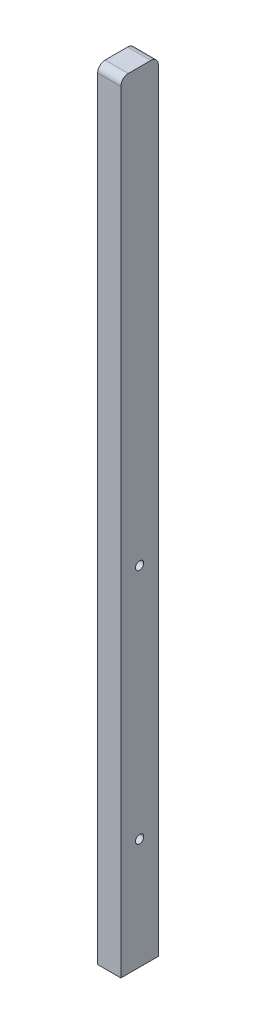
ISO-10303-21;
HEADER;
FILE_DESCRIPTION(('STEP AP214'),'2;1');
FILE_NAME('part.step','',(''),(''),'','','');
FILE_SCHEMA(('AUTOMOTIVE_DESIGN { 1 0 10303 214 1 1 1 1 }'));
ENDSEC;
DATA;
#1=APPLICATION_CONTEXT('core data for automotive mechanical design processes');
#2=APPLICATION_PROTOCOL_DEFINITION('international standard','automotive_design',2000,#1);
#3=PRODUCT_CONTEXT('',#1,'mechanical');
#4=PRODUCT('Part','Part','',(#3));
#5=PRODUCT_RELATED_PRODUCT_CATEGORY('part','',(#4));
#6=PRODUCT_DEFINITION_FORMATION('','',#4);
#7=PRODUCT_DEFINITION_CONTEXT('part definition',#1,'design');
#8=PRODUCT_DEFINITION('design','',#6,#7);
#9=PRODUCT_DEFINITION_SHAPE('','',#8);
#10=(LENGTH_UNIT() NAMED_UNIT(*) SI_UNIT(.MILLI.,.METRE.));
#11=(NAMED_UNIT(*) PLANE_ANGLE_UNIT() SI_UNIT($,.RADIAN.));
#12=(NAMED_UNIT(*) SI_UNIT($,.STERADIAN.) SOLID_ANGLE_UNIT());
#13=UNCERTAINTY_MEASURE_WITH_UNIT(LENGTH_MEASURE(1.E-05),#10,'distance_accuracy_value','');
#14=(GEOMETRIC_REPRESENTATION_CONTEXT(3) GLOBAL_UNCERTAINTY_ASSIGNED_CONTEXT((#13)) GLOBAL_UNIT_ASSIGNED_CONTEXT((#10,
#11,#12)) REPRESENTATION_CONTEXT('',''));
#15=CARTESIAN_POINT('',(0.,0.,0.));
#16=DIRECTION('',(0.,0.,1.));
#17=DIRECTION('',(1.,0.,0.));
#18=AXIS2_PLACEMENT_3D('',#15,#16,#17);
#19=CARTESIAN_POINT('',(-7.75,520.,12.5));
#20=DIRECTION('',(1.,0.,0.));
#21=DIRECTION('',(0.,0.,-1.));
#22=AXIS2_PLACEMENT_3D('',#19,#20,#21);
#23=PLANE('',#22);
#24=CARTESIAN_POINT('',(-7.75,74.,0.));
#25=DIRECTION('',(-1.,0.,0.));
#26=DIRECTION('',(0.,0.,1.));
#27=AXIS2_PLACEMENT_3D('',#24,#25,#26);
#28=CIRCLE('',#27,4.99999999999999);
#29=CARTESIAN_POINT('',(-7.75,74.,4.99999999999999));
#30=VERTEX_POINT('',#29);
#31=EDGE_CURVE('E255',#30,#30,#28,.T.);
#32=ORIENTED_EDGE('',*,*,#31,.F.);
#33=EDGE_LOOP('',(#32));
#34=FACE_BOUND('',#33,.T.);
#35=CARTESIAN_POINT('',(-7.75,232.,0.));
#36=DIRECTION('',(-1.,0.,0.));
#37=DIRECTION('',(0.,0.,1.));
#38=AXIS2_PLACEMENT_3D('',#35,#36,#37);
#39=CIRCLE('',#38,5.);
#40=CARTESIAN_POINT('',(-7.75,232.,5.));
#41=VERTEX_POINT('',#40);
#42=EDGE_CURVE('E269',#41,#41,#39,.T.);
#43=ORIENTED_EDGE('',*,*,#42,.F.);
#44=EDGE_LOOP('',(#43));
#45=FACE_BOUND('',#44,.T.);
#46=DIRECTION('',(0.,-1.,0.));
#47=VECTOR('',#46,1.);
#48=CARTESIAN_POINT('',(-7.75,520.,12.5));
#49=LINE('',#48,#47);
#50=CARTESIAN_POINT('',(-7.75,515.,12.5));
#51=VERTEX_POINT('',#50);
#52=CARTESIAN_POINT('',(-7.75,0.,12.5));
#53=VERTEX_POINT('',#52);
#54=EDGE_CURVE('E150',#51,#53,#49,.T.);
#55=ORIENTED_EDGE('',*,*,#54,.F.);
#56=CARTESIAN_POINT('',(-7.75,515.,7.5));
#57=DIRECTION('',(1.,0.,0.));
#58=DIRECTION('',(0.,0.,-1.));
#59=AXIS2_PLACEMENT_3D('',#56,#57,#58);
#60=CIRCLE('',#59,5.);
#61=CARTESIAN_POINT('',(-7.75,520.,7.5));
#62=VERTEX_POINT('',#61);
#63=EDGE_CURVE('E53',#51,#62,#60,.F.);
#64=ORIENTED_EDGE('',*,*,#63,.T.);
#65=DIRECTION('',(0.,0.,1.));
#66=VECTOR('',#65,1.);
#67=CARTESIAN_POINT('',(-7.75,520.,12.5));
#68=LINE('',#67,#66);
#69=CARTESIAN_POINT('',(-7.75,520.,-7.49999999999999));
#70=VERTEX_POINT('',#69);
#71=EDGE_CURVE('E122',#70,#62,#68,.T.);
#72=ORIENTED_EDGE('',*,*,#71,.F.);
#73=CARTESIAN_POINT('',(-7.75,515.,-7.5));
#74=DIRECTION('',(1.,0.,0.));
#75=DIRECTION('',(0.,0.,-1.));
#76=AXIS2_PLACEMENT_3D('',#73,#74,#75);
#77=CIRCLE('',#76,5.);
#78=CARTESIAN_POINT('',(-7.75,515.,-12.5));
#79=VERTEX_POINT('',#78);
#80=EDGE_CURVE('E60',#70,#79,#77,.F.);
#81=ORIENTED_EDGE('',*,*,#80,.T.);
#82=DIRECTION('',(0.,-1.,0.));
#83=VECTOR('',#82,1.);
#84=CARTESIAN_POINT('',(-7.75,520.,-12.5));
#85=LINE('',#84,#83);
#86=CARTESIAN_POINT('',(-7.75,0.,-12.5));
#87=VERTEX_POINT('',#86);
#88=EDGE_CURVE('E130',#79,#87,#85,.T.);
#89=ORIENTED_EDGE('',*,*,#88,.T.);
#90=DIRECTION('',(0.,0.,1.));
#91=VECTOR('',#90,1.);
#92=CARTESIAN_POINT('',(-7.75,0.,12.5));
#93=LINE('',#92,#91);
#94=EDGE_CURVE('E109',#87,#53,#93,.T.);
#95=ORIENTED_EDGE('',*,*,#94,.T.);
#96=EDGE_LOOP('',(#55,#64,#72,#81,#89,#95));
#97=FACE_BOUND('',#96,.T.);
#98=ADVANCED_FACE('F44',(#34,#45,#97),#23,.F.);
#99=CARTESIAN_POINT('',(7.75,520.,12.5));
#100=DIRECTION('',(0.,0.,-1.));
#101=DIRECTION('',(-1.,0.,0.));
#102=AXIS2_PLACEMENT_3D('',#99,#100,#101);
#103=PLANE('',#102);
#104=DIRECTION('',(0.,-1.,0.));
#105=VECTOR('',#104,1.);
#106=CARTESIAN_POINT('',(7.75,520.,12.5));
#107=LINE('',#106,#105);
#108=CARTESIAN_POINT('',(7.75,515.,12.5));
#109=VERTEX_POINT('',#108);
#110=CARTESIAN_POINT('',(7.75,0.,12.5));
#111=VERTEX_POINT('',#110);
#112=EDGE_CURVE('E147',#109,#111,#107,.T.);
#113=ORIENTED_EDGE('',*,*,#112,.F.);
#114=DIRECTION('',(1.,0.,0.));
#115=VECTOR('',#114,1.);
#116=CARTESIAN_POINT('',(-7.75,515.,12.5));
#117=LINE('',#116,#115);
#118=EDGE_CURVE('E68',#109,#51,#117,.F.);
#119=ORIENTED_EDGE('',*,*,#118,.T.);
#120=ORIENTED_EDGE('',*,*,#54,.T.);
#121=DIRECTION('',(1.,0.,0.));
#122=VECTOR('',#121,1.);
#123=CARTESIAN_POINT('',(7.75,0.,12.5));
#124=LINE('',#123,#122);
#125=EDGE_CURVE('E115',#53,#111,#124,.T.);
#126=ORIENTED_EDGE('',*,*,#125,.T.);
#127=EDGE_LOOP('',(#113,#119,#120,#126));
#128=FACE_BOUND('',#127,.T.);
#129=ADVANCED_FACE('F181',(#128),#103,.F.);
#130=CARTESIAN_POINT('',(7.75,520.,12.5));
#131=DIRECTION('',(-1.,0.,0.));
#132=DIRECTION('',(0.,0.,1.));
#133=AXIS2_PLACEMENT_3D('',#130,#131,#132);
#134=PLANE('',#133);
#135=CARTESIAN_POINT('',(7.75,74.,0.));
#136=DIRECTION('',(-1.,0.,0.));
#137=DIRECTION('',(0.,0.,1.));
#138=AXIS2_PLACEMENT_3D('',#135,#136,#137);
#139=CIRCLE('',#138,2.74999999999999);
#140=CARTESIAN_POINT('',(7.75,74.,2.74999999999999));
#141=VERTEX_POINT('',#140);
#142=EDGE_CURVE('E265',#141,#141,#139,.T.);
#143=ORIENTED_EDGE('',*,*,#142,.T.);
#144=EDGE_LOOP('',(#143));
#145=FACE_BOUND('',#144,.T.);
#146=CARTESIAN_POINT('',(7.75,232.,0.));
#147=DIRECTION('',(-1.,0.,0.));
#148=DIRECTION('',(0.,0.,1.));
#149=AXIS2_PLACEMENT_3D('',#146,#147,#148);
#150=CIRCLE('',#149,2.75);
#151=CARTESIAN_POINT('',(7.75,232.,2.75));
#152=VERTEX_POINT('',#151);
#153=EDGE_CURVE('E118',#152,#152,#150,.T.);
#154=ORIENTED_EDGE('',*,*,#153,.T.);
#155=EDGE_LOOP('',(#154));
#156=FACE_BOUND('',#155,.T.);
#157=DIRECTION('',(0.,0.,-1.));
#158=VECTOR('',#157,1.);
#159=CARTESIAN_POINT('',(7.75,520.,12.5));
#160=LINE('',#159,#158);
#161=CARTESIAN_POINT('',(7.75,520.,7.5));
#162=VERTEX_POINT('',#161);
#163=CARTESIAN_POINT('',(7.75,520.,-7.5));
#164=VERTEX_POINT('',#163);
#165=EDGE_CURVE('E126',#162,#164,#160,.T.);
#166=ORIENTED_EDGE('',*,*,#165,.F.);
#167=CARTESIAN_POINT('',(7.75,515.,7.5));
#168=DIRECTION('',(-1.,0.,0.));
#169=DIRECTION('',(0.,0.,1.));
#170=AXIS2_PLACEMENT_3D('',#167,#168,#169);
#171=CIRCLE('',#170,5.);
#172=EDGE_CURVE('E164',#162,#109,#171,.F.);
#173=ORIENTED_EDGE('',*,*,#172,.T.);
#174=ORIENTED_EDGE('',*,*,#112,.T.);
#175=DIRECTION('',(0.,0.,-1.));
#176=VECTOR('',#175,1.);
#177=CARTESIAN_POINT('',(7.75,0.,12.5));
#178=LINE('',#177,#176);
#179=CARTESIAN_POINT('',(7.75,0.,-12.5));
#180=VERTEX_POINT('',#179);
#181=EDGE_CURVE('E135',#111,#180,#178,.T.);
#182=ORIENTED_EDGE('',*,*,#181,.T.);
#183=DIRECTION('',(0.,-1.,0.));
#184=VECTOR('',#183,1.);
#185=CARTESIAN_POINT('',(7.75,520.,-12.5));
#186=LINE('',#185,#184);
#187=CARTESIAN_POINT('',(7.75,515.,-12.5));
#188=VERTEX_POINT('',#187);
#189=EDGE_CURVE('E144',#188,#180,#186,.T.);
#190=ORIENTED_EDGE('',*,*,#189,.F.);
#191=CARTESIAN_POINT('',(7.75,515.,-7.5));
#192=DIRECTION('',(-1.,0.,0.));
#193=DIRECTION('',(0.,0.,1.));
#194=AXIS2_PLACEMENT_3D('',#191,#192,#193);
#195=CIRCLE('',#194,5.);
#196=EDGE_CURVE('E161',#188,#164,#195,.F.);
#197=ORIENTED_EDGE('',*,*,#196,.T.);
#198=EDGE_LOOP('',(#166,#173,#174,#182,#190,#197));
#199=FACE_BOUND('',#198,.T.);
#200=ADVANCED_FACE('F180',(#145,#156,#199),#134,.F.);
#201=CARTESIAN_POINT('',(7.75,520.,-12.5));
#202=DIRECTION('',(0.,0.,1.));
#203=DIRECTION('',(1.,0.,0.));
#204=AXIS2_PLACEMENT_3D('',#201,#202,#203);
#205=PLANE('',#204);
#206=ORIENTED_EDGE('',*,*,#88,.F.);
#207=DIRECTION('',(-1.,0.,0.));
#208=VECTOR('',#207,1.);
#209=CARTESIAN_POINT('',(7.75,515.,-12.5));
#210=LINE('',#209,#208);
#211=EDGE_CURVE('E11',#79,#188,#210,.F.);
#212=ORIENTED_EDGE('',*,*,#211,.T.);
#213=ORIENTED_EDGE('',*,*,#189,.T.);
#214=DIRECTION('',(-1.,0.,0.));
#215=VECTOR('',#214,1.);
#216=CARTESIAN_POINT('',(7.75,0.,-12.5));
#217=LINE('',#216,#215);
#218=EDGE_CURVE('E127',#180,#87,#217,.T.);
#219=ORIENTED_EDGE('',*,*,#218,.T.);
#220=EDGE_LOOP('',(#206,#212,#213,#219));
#221=FACE_BOUND('',#220,.T.);
#222=ADVANCED_FACE('F193',(#221),#205,.F.);
#223=CARTESIAN_POINT('',(0.,520.,0.));
#224=DIRECTION('',(0.,1.,0.));
#225=DIRECTION('',(0.,0.,1.));
#226=AXIS2_PLACEMENT_3D('',#223,#224,#225);
#227=PLANE('',#226);
#228=ORIENTED_EDGE('',*,*,#71,.T.);
#229=DIRECTION('',(1.,0.,0.));
#230=VECTOR('',#229,1.);
#231=CARTESIAN_POINT('',(7.75,520.,7.5));
#232=LINE('',#231,#230);
#233=EDGE_CURVE('E157',#62,#162,#232,.T.);
#234=ORIENTED_EDGE('',*,*,#233,.T.);
#235=ORIENTED_EDGE('',*,*,#165,.T.);
#236=DIRECTION('',(-1.,0.,0.));
#237=VECTOR('',#236,1.);
#238=CARTESIAN_POINT('',(-7.75,520.,-7.5));
#239=LINE('',#238,#237);
#240=EDGE_CURVE('E153',#164,#70,#239,.T.);
#241=ORIENTED_EDGE('',*,*,#240,.T.);
#242=EDGE_LOOP('',(#228,#234,#235,#241));
#243=FACE_BOUND('',#242,.T.);
#244=ADVANCED_FACE('F175',(#243),#227,.T.);
#245=CARTESIAN_POINT('',(0.,0.,0.));
#246=DIRECTION('',(0.,1.,0.));
#247=DIRECTION('',(0.,0.,1.));
#248=AXIS2_PLACEMENT_3D('',#245,#246,#247);
#249=PLANE('',#248);
#250=CARTESIAN_POINT('',(0.,0.,0.));
#251=DIRECTION('',(0.,-1.,0.));
#252=DIRECTION('',(0.,0.,-1.));
#253=AXIS2_PLACEMENT_3D('',#250,#251,#252);
#254=CIRCLE('',#253,3.3);
#255=CARTESIAN_POINT('',(0.,0.,-3.3));
#256=VERTEX_POINT('',#255);
#257=EDGE_CURVE('E110',#256,#256,#254,.T.);
#258=ORIENTED_EDGE('',*,*,#257,.F.);
#259=EDGE_LOOP('',(#258));
#260=FACE_BOUND('',#259,.T.);
#261=ORIENTED_EDGE('',*,*,#94,.F.);
#262=ORIENTED_EDGE('',*,*,#218,.F.);
#263=ORIENTED_EDGE('',*,*,#181,.F.);
#264=ORIENTED_EDGE('',*,*,#125,.F.);
#265=EDGE_LOOP('',(#261,#262,#263,#264));
#266=FACE_BOUND('',#265,.T.);
#267=ADVANCED_FACE('F187',(#260,#266),#249,.F.);
#268=CARTESIAN_POINT('',(0.,515.,7.5));
#269=DIRECTION('',(-1.,0.,0.));
#270=DIRECTION('',(0.,0.,1.));
#271=AXIS2_PLACEMENT_3D('',#268,#269,#270);
#272=CYLINDRICAL_SURFACE('',#271,5.);
#273=ORIENTED_EDGE('',*,*,#63,.F.);
#274=ORIENTED_EDGE('',*,*,#118,.F.);
#275=ORIENTED_EDGE('',*,*,#172,.F.);
#276=ORIENTED_EDGE('',*,*,#233,.F.);
#277=EDGE_LOOP('',(#273,#274,#275,#276));
#278=FACE_BOUND('',#277,.T.);
#279=ADVANCED_FACE('F178',(#278),#272,.T.);
#280=CARTESIAN_POINT('',(0.,515.,-7.5));
#281=DIRECTION('',(1.,0.,0.));
#282=DIRECTION('',(0.,0.,-1.));
#283=AXIS2_PLACEMENT_3D('',#280,#281,#282);
#284=CYLINDRICAL_SURFACE('',#283,5.);
#285=ORIENTED_EDGE('',*,*,#196,.F.);
#286=ORIENTED_EDGE('',*,*,#211,.F.);
#287=ORIENTED_EDGE('',*,*,#80,.F.);
#288=ORIENTED_EDGE('',*,*,#240,.F.);
#289=EDGE_LOOP('',(#285,#286,#287,#288));
#290=FACE_BOUND('',#289,.T.);
#291=ADVANCED_FACE('F46',(#290),#284,.T.);
#292=CARTESIAN_POINT('',(0.,12.,0.));
#293=DIRECTION('',(0.,-1.,0.));
#294=DIRECTION('',(0.,0.,-1.));
#295=AXIS2_PLACEMENT_3D('',#292,#293,#294);
#296=CONICAL_SURFACE('',#295,3.3,1.02974425867665);
#297=CARTESIAN_POINT('',(0.,13.9828400427909,0.));
#298=VERTEX_POINT('',#297);
#299=VERTEX_LOOP('',#298);
#300=FACE_BOUND('',#299,.T.);
#301=CARTESIAN_POINT('',(0.,12.,0.));
#302=DIRECTION('',(0.,-1.,0.));
#303=DIRECTION('',(0.,0.,-1.));
#304=AXIS2_PLACEMENT_3D('',#301,#302,#303);
#305=CIRCLE('',#304,3.3);
#306=CARTESIAN_POINT('',(0.,12.,-3.3));
#307=VERTEX_POINT('',#306);
#308=EDGE_CURVE('E106',#307,#307,#305,.T.);
#309=ORIENTED_EDGE('',*,*,#308,.T.);
#310=EDGE_LOOP('',(#309));
#311=FACE_BOUND('',#310,.T.);
#312=ADVANCED_FACE('F99',(#300,#311),#296,.F.);
#313=CARTESIAN_POINT('',(0.,0.,0.));
#314=DIRECTION('',(0.,-1.,0.));
#315=DIRECTION('',(0.,0.,-1.));
#316=AXIS2_PLACEMENT_3D('',#313,#314,#315);
#317=CYLINDRICAL_SURFACE('',#316,3.3);
#318=ORIENTED_EDGE('',*,*,#308,.F.);
#319=EDGE_LOOP('',(#318));
#320=FACE_BOUND('',#319,.T.);
#321=ORIENTED_EDGE('',*,*,#257,.T.);
#322=EDGE_LOOP('',(#321));
#323=FACE_BOUND('',#322,.T.);
#324=ADVANCED_FACE('F102',(#320,#323),#317,.F.);
#325=CARTESIAN_POINT('',(-7.75,232.,0.));
#326=DIRECTION('',(-1.,0.,0.));
#327=DIRECTION('',(0.,0.,1.));
#328=AXIS2_PLACEMENT_3D('',#325,#326,#327);
#329=CYLINDRICAL_SURFACE('',#328,2.75);
#330=ORIENTED_EDGE('',*,*,#153,.F.);
#331=EDGE_LOOP('',(#330));
#332=FACE_BOUND('',#331,.T.);
#333=CARTESIAN_POINT('',(-2.35,232.,0.));
#334=DIRECTION('',(-1.,0.,0.));
#335=DIRECTION('',(0.,0.,1.));
#336=AXIS2_PLACEMENT_3D('',#333,#334,#335);
#337=CIRCLE('',#336,2.75);
#338=CARTESIAN_POINT('',(-2.35,232.,2.75));
#339=VERTEX_POINT('',#338);
#340=EDGE_CURVE('E277',#339,#339,#337,.T.);
#341=ORIENTED_EDGE('',*,*,#340,.T.);
#342=EDGE_LOOP('',(#341));
#343=FACE_BOUND('',#342,.T.);
#344=ADVANCED_FACE('F225',(#332,#343),#329,.F.);
#345=CARTESIAN_POINT('',(-2.35,234.75,0.));
#346=DIRECTION('',(1.,0.,0.));
#347=DIRECTION('',(0.,0.,-1.));
#348=AXIS2_PLACEMENT_3D('',#345,#346,#347);
#349=PLANE('',#348);
#350=ORIENTED_EDGE('',*,*,#340,.F.);
#351=EDGE_LOOP('',(#350));
#352=FACE_BOUND('',#351,.T.);
#353=CARTESIAN_POINT('',(-2.35,232.,0.));
#354=DIRECTION('',(-1.,0.,0.));
#355=DIRECTION('',(0.,0.,1.));
#356=AXIS2_PLACEMENT_3D('',#353,#354,#355);
#357=CIRCLE('',#356,5.);
#358=CARTESIAN_POINT('',(-2.35,232.,5.));
#359=VERTEX_POINT('',#358);
#360=EDGE_CURVE('E273',#359,#359,#357,.T.);
#361=ORIENTED_EDGE('',*,*,#360,.T.);
#362=EDGE_LOOP('',(#361));
#363=FACE_BOUND('',#362,.T.);
#364=ADVANCED_FACE('F228',(#352,#363),#349,.F.);
#365=CARTESIAN_POINT('',(-7.75,232.,0.));
#366=DIRECTION('',(-1.,0.,0.));
#367=DIRECTION('',(0.,0.,1.));
#368=AXIS2_PLACEMENT_3D('',#365,#366,#367);
#369=CYLINDRICAL_SURFACE('',#368,5.);
#370=ORIENTED_EDGE('',*,*,#360,.F.);
#371=EDGE_LOOP('',(#370));
#372=FACE_BOUND('',#371,.T.);
#373=ORIENTED_EDGE('',*,*,#42,.T.);
#374=EDGE_LOOP('',(#373));
#375=FACE_BOUND('',#374,.T.);
#376=ADVANCED_FACE('F232',(#372,#375),#369,.F.);
#377=CARTESIAN_POINT('',(-7.75,74.,0.));
#378=DIRECTION('',(-1.,0.,0.));
#379=DIRECTION('',(0.,0.,1.));
#380=AXIS2_PLACEMENT_3D('',#377,#378,#379);
#381=CYLINDRICAL_SURFACE('',#380,2.75);
#382=ORIENTED_EDGE('',*,*,#142,.F.);
#383=EDGE_LOOP('',(#382));
#384=FACE_BOUND('',#383,.T.);
#385=CARTESIAN_POINT('',(-2.35,74.,0.));
#386=DIRECTION('',(-1.,0.,0.));
#387=DIRECTION('',(0.,0.,1.));
#388=AXIS2_PLACEMENT_3D('',#385,#386,#387);
#389=CIRCLE('',#388,2.75000000000002);
#390=CARTESIAN_POINT('',(-2.35,74.,2.75000000000002));
#391=VERTEX_POINT('',#390);
#392=EDGE_CURVE('E259',#391,#391,#389,.T.);
#393=ORIENTED_EDGE('',*,*,#392,.T.);
#394=EDGE_LOOP('',(#393));
#395=FACE_BOUND('',#394,.T.);
#396=ADVANCED_FACE('F236',(#384,#395),#381,.F.);
#397=CARTESIAN_POINT('',(-2.35,76.75,0.));
#398=DIRECTION('',(1.,0.,0.));
#399=DIRECTION('',(0.,0.,-1.));
#400=AXIS2_PLACEMENT_3D('',#397,#398,#399);
#401=PLANE('',#400);
#402=ORIENTED_EDGE('',*,*,#392,.F.);
#403=EDGE_LOOP('',(#402));
#404=FACE_BOUND('',#403,.T.);
#405=CARTESIAN_POINT('',(-2.35,74.,0.));
#406=DIRECTION('',(-1.,0.,0.));
#407=DIRECTION('',(0.,0.,1.));
#408=AXIS2_PLACEMENT_3D('',#405,#406,#407);
#409=CIRCLE('',#408,4.99999999999999);
#410=CARTESIAN_POINT('',(-2.35,74.,4.99999999999999));
#411=VERTEX_POINT('',#410);
#412=EDGE_CURVE('E253',#411,#411,#409,.T.);
#413=ORIENTED_EDGE('',*,*,#412,.T.);
#414=EDGE_LOOP('',(#413));
#415=FACE_BOUND('',#414,.T.);
#416=ADVANCED_FACE('F240',(#404,#415),#401,.F.);
#417=CARTESIAN_POINT('',(-7.75,74.,0.));
#418=DIRECTION('',(-1.,0.,0.));
#419=DIRECTION('',(0.,0.,1.));
#420=AXIS2_PLACEMENT_3D('',#417,#418,#419);
#421=CYLINDRICAL_SURFACE('',#420,4.99999999999999);
#422=ORIENTED_EDGE('',*,*,#412,.F.);
#423=EDGE_LOOP('',(#422));
#424=FACE_BOUND('',#423,.T.);
#425=ORIENTED_EDGE('',*,*,#31,.T.);
#426=EDGE_LOOP('',(#425));
#427=FACE_BOUND('',#426,.T.);
#428=ADVANCED_FACE('F244',(#424,#427),#421,.F.);
#429=CLOSED_SHELL('',(#98,#129,#200,#222,#244,#267,#279,#291,#312,#324,#344,#364,#376,#396,#416,#428));
#430=MANIFOLD_SOLID_BREP('B2',#429);
#431=ADVANCED_BREP_SHAPE_REPRESENTATION('',(#18,#430),#14);
#432=SHAPE_DEFINITION_REPRESENTATION(#9,#431);
ENDSEC;
END-ISO-10303-21;
